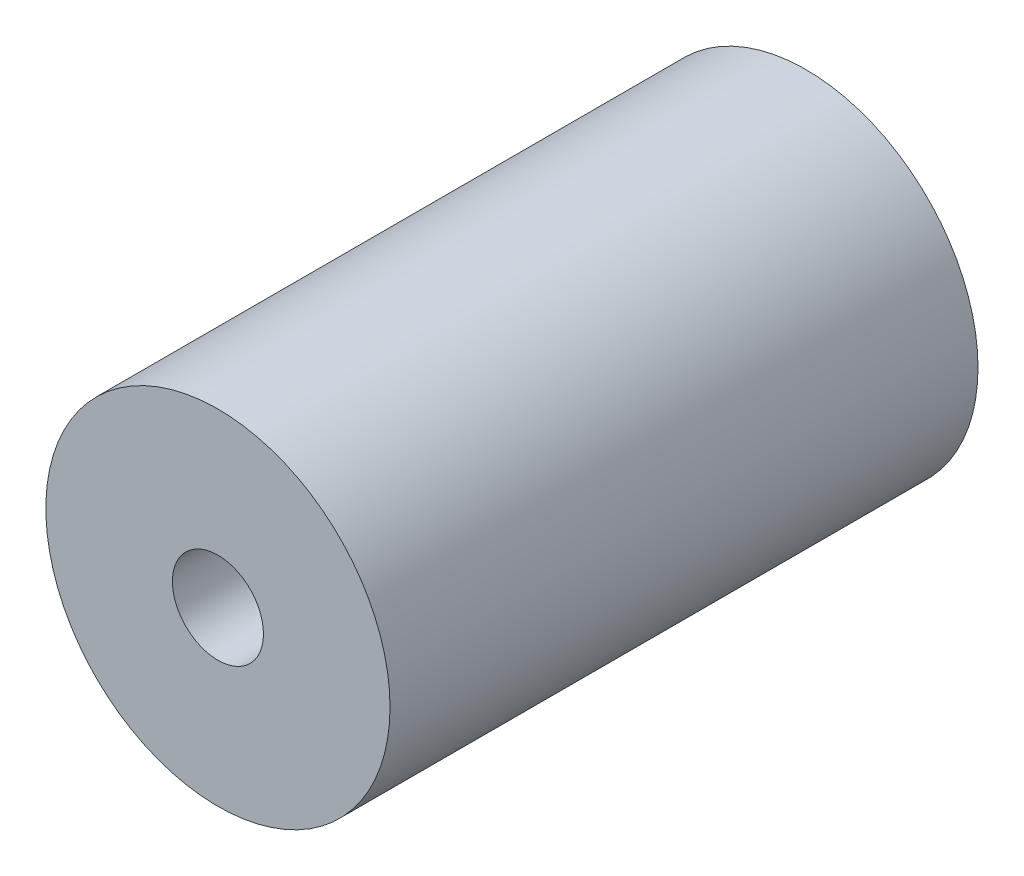
ISO-10303-21;
HEADER;
FILE_DESCRIPTION(('STEP AP214'),'2;1');
FILE_NAME('part.step','',(''),(''),'','','');
FILE_SCHEMA(('AUTOMOTIVE_DESIGN { 1 0 10303 214 1 1 1 1 }'));
ENDSEC;
DATA;
#1=APPLICATION_CONTEXT('core data for automotive mechanical design processes');
#2=APPLICATION_PROTOCOL_DEFINITION('international standard','automotive_design',2000,#1);
#3=PRODUCT_CONTEXT('',#1,'mechanical');
#4=PRODUCT('Part','Part','',(#3));
#5=PRODUCT_RELATED_PRODUCT_CATEGORY('part','',(#4));
#6=PRODUCT_DEFINITION_FORMATION('','',#4);
#7=PRODUCT_DEFINITION_CONTEXT('part definition',#1,'design');
#8=PRODUCT_DEFINITION('design','',#6,#7);
#9=PRODUCT_DEFINITION_SHAPE('','',#8);
#10=(LENGTH_UNIT() NAMED_UNIT(*) SI_UNIT(.MILLI.,.METRE.));
#11=(NAMED_UNIT(*) PLANE_ANGLE_UNIT() SI_UNIT($,.RADIAN.));
#12=(NAMED_UNIT(*) SI_UNIT($,.STERADIAN.) SOLID_ANGLE_UNIT());
#13=UNCERTAINTY_MEASURE_WITH_UNIT(LENGTH_MEASURE(1.E-05),#10,'distance_accuracy_value','');
#14=(GEOMETRIC_REPRESENTATION_CONTEXT(3) GLOBAL_UNCERTAINTY_ASSIGNED_CONTEXT((#13)) GLOBAL_UNIT_ASSIGNED_CONTEXT((#10,
#11,#12)) REPRESENTATION_CONTEXT('',''));
#15=CARTESIAN_POINT('',(0.,0.,0.));
#16=DIRECTION('',(0.,0.,1.));
#17=DIRECTION('',(1.,0.,0.));
#18=AXIS2_PLACEMENT_3D('',#15,#16,#17);
#19=CARTESIAN_POINT('',(-4.3781473270553,5.74503363960222,-10.));
#20=DIRECTION('',(0.,0.,1.));
#21=DIRECTION('',(1.,0.,0.));
#22=AXIS2_PLACEMENT_3D('',#19,#20,#21);
#23=CYLINDRICAL_SURFACE('',#22,6.);
#24=CARTESIAN_POINT('',(-4.3781473270553,5.74503363960222,-10.));
#25=DIRECTION('',(0.,0.,1.));
#26=DIRECTION('',(1.,0.,0.));
#27=AXIS2_PLACEMENT_3D('',#24,#25,#26);
#28=CIRCLE('',#27,6.);
#29=CARTESIAN_POINT('',(1.6218526729447,5.74503363960222,-10.));
#30=VERTEX_POINT('',#29);
#31=EDGE_CURVE('E10',#30,#30,#28,.T.);
#32=ORIENTED_EDGE('',*,*,#31,.T.);
#33=EDGE_LOOP('',(#32));
#34=FACE_BOUND('',#33,.T.);
#35=CARTESIAN_POINT('',(-4.3781473270553,5.74503363960222,10.5));
#36=DIRECTION('',(0.,0.,1.));
#37=DIRECTION('',(1.,0.,0.));
#38=AXIS2_PLACEMENT_3D('',#35,#36,#37);
#39=CIRCLE('',#38,6.);
#40=CARTESIAN_POINT('',(1.6218526729447,5.74503363960222,10.5));
#41=VERTEX_POINT('',#40);
#42=EDGE_CURVE('E45',#41,#41,#39,.T.);
#43=ORIENTED_EDGE('',*,*,#42,.F.);
#44=EDGE_LOOP('',(#43));
#45=FACE_BOUND('',#44,.T.);
#46=ADVANCED_FACE('F35',(#34,#45),#23,.T.);
#47=CARTESIAN_POINT('',(-4.3781473270553,5.74503363960222,-10.));
#48=DIRECTION('',(0.,0.,1.));
#49=DIRECTION('',(1.,0.,0.));
#50=AXIS2_PLACEMENT_3D('',#47,#48,#49);
#51=PLANE('',#50);
#52=CARTESIAN_POINT('',(-4.3781473270553,5.74503363960222,-10.));
#53=DIRECTION('',(0.,0.,1.));
#54=DIRECTION('',(1.,0.,0.));
#55=AXIS2_PLACEMENT_3D('',#52,#53,#54);
#56=CIRCLE('',#55,1.5875);
#57=CARTESIAN_POINT('',(-2.7906473270553,5.74503363960222,-10.));
#58=VERTEX_POINT('',#57);
#59=EDGE_CURVE('E41',#58,#58,#56,.T.);
#60=ORIENTED_EDGE('',*,*,#59,.T.);
#61=EDGE_LOOP('',(#60));
#62=FACE_BOUND('',#61,.T.);
#63=ORIENTED_EDGE('',*,*,#31,.F.);
#64=EDGE_LOOP('',(#63));
#65=FACE_BOUND('',#64,.T.);
#66=ADVANCED_FACE('F64',(#62,#65),#51,.F.);
#67=CARTESIAN_POINT('',(-4.3781473270553,5.74503363960222,-10.));
#68=DIRECTION('',(0.,0.,1.));
#69=DIRECTION('',(1.,0.,0.));
#70=AXIS2_PLACEMENT_3D('',#67,#68,#69);
#71=CYLINDRICAL_SURFACE('',#70,1.5875);
#72=ORIENTED_EDGE('',*,*,#59,.F.);
#73=EDGE_LOOP('',(#72));
#74=FACE_BOUND('',#73,.T.);
#75=CARTESIAN_POINT('',(-4.3781473270553,5.74503363960222,10.5));
#76=DIRECTION('',(0.,0.,1.));
#77=DIRECTION('',(1.,0.,0.));
#78=AXIS2_PLACEMENT_3D('',#75,#76,#77);
#79=CIRCLE('',#78,1.5875);
#80=CARTESIAN_POINT('',(-2.7906473270553,5.74503363960222,10.5));
#81=VERTEX_POINT('',#80);
#82=EDGE_CURVE('E49',#81,#81,#79,.T.);
#83=ORIENTED_EDGE('',*,*,#82,.T.);
#84=EDGE_LOOP('',(#83));
#85=FACE_BOUND('',#84,.T.);
#86=ADVANCED_FACE('F55',(#74,#85),#71,.F.);
#87=CARTESIAN_POINT('',(-4.3781473270553,5.74503363960222,10.5));
#88=DIRECTION('',(0.,0.,1.));
#89=DIRECTION('',(1.,0.,0.));
#90=AXIS2_PLACEMENT_3D('',#87,#88,#89);
#91=PLANE('',#90);
#92=ORIENTED_EDGE('',*,*,#42,.T.);
#93=EDGE_LOOP('',(#92));
#94=FACE_BOUND('',#93,.T.);
#95=ORIENTED_EDGE('',*,*,#82,.F.);
#96=EDGE_LOOP('',(#95));
#97=FACE_BOUND('',#96,.T.);
#98=ADVANCED_FACE('F57',(#94,#97),#91,.T.);
#99=CLOSED_SHELL('',(#46,#66,#86,#98));
#100=MANIFOLD_SOLID_BREP('B2',#99);
#101=ADVANCED_BREP_SHAPE_REPRESENTATION('',(#18,#100),#14);
#102=SHAPE_DEFINITION_REPRESENTATION(#9,#101);
ENDSEC;
END-ISO-10303-21;
